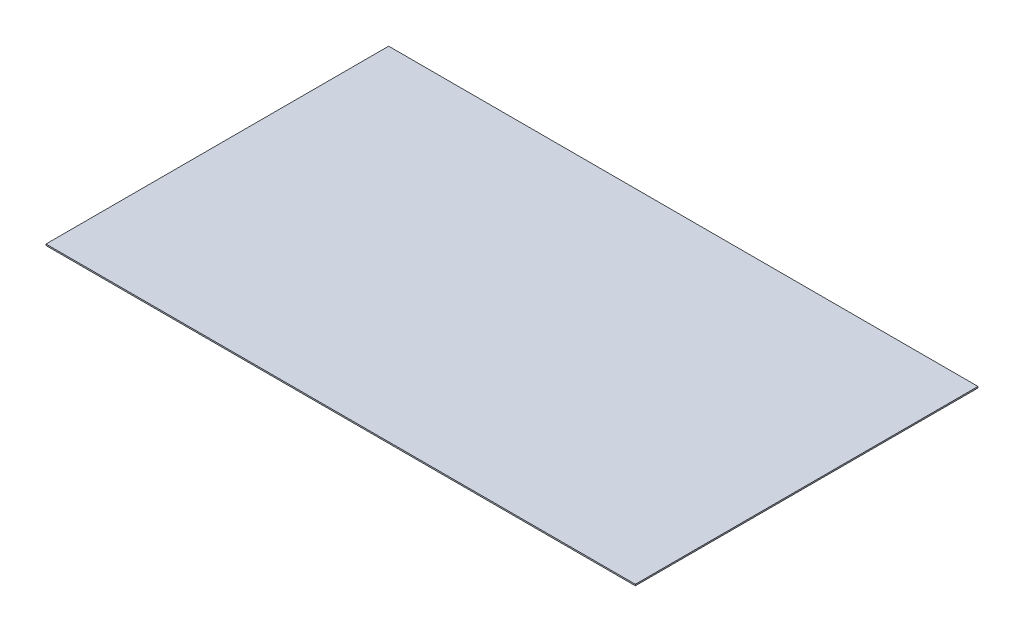
ISO-10303-21;
HEADER;
FILE_DESCRIPTION(('STEP AP214'),'2;1');
FILE_NAME('part.step','',(''),(''),'','','');
FILE_SCHEMA(('AUTOMOTIVE_DESIGN { 1 0 10303 214 1 1 1 1 }'));
ENDSEC;
DATA;
#1=APPLICATION_CONTEXT('core data for automotive mechanical design processes');
#2=APPLICATION_PROTOCOL_DEFINITION('international standard','automotive_design',2000,#1);
#3=PRODUCT_CONTEXT('',#1,'mechanical');
#4=PRODUCT('Part','Part','',(#3));
#5=PRODUCT_RELATED_PRODUCT_CATEGORY('part','',(#4));
#6=PRODUCT_DEFINITION_FORMATION('','',#4);
#7=PRODUCT_DEFINITION_CONTEXT('part definition',#1,'design');
#8=PRODUCT_DEFINITION('design','',#6,#7);
#9=PRODUCT_DEFINITION_SHAPE('','',#8);
#10=(LENGTH_UNIT() NAMED_UNIT(*) SI_UNIT(.MILLI.,.METRE.));
#11=(NAMED_UNIT(*) PLANE_ANGLE_UNIT() SI_UNIT($,.RADIAN.));
#12=(NAMED_UNIT(*) SI_UNIT($,.STERADIAN.) SOLID_ANGLE_UNIT());
#13=UNCERTAINTY_MEASURE_WITH_UNIT(LENGTH_MEASURE(1.E-05),#10,'distance_accuracy_value','');
#14=(GEOMETRIC_REPRESENTATION_CONTEXT(3) GLOBAL_UNCERTAINTY_ASSIGNED_CONTEXT((#13)) GLOBAL_UNIT_ASSIGNED_CONTEXT((#10,
#11,#12)) REPRESENTATION_CONTEXT('',''));
#15=CARTESIAN_POINT('',(0.,0.,0.));
#16=DIRECTION('',(0.,0.,1.));
#17=DIRECTION('',(1.,0.,0.));
#18=AXIS2_PLACEMENT_3D('',#15,#16,#17);
#19=CARTESIAN_POINT('',(0.,1.,0.));
#20=DIRECTION('',(1.,0.,0.));
#21=DIRECTION('',(0.,0.,-1.));
#22=AXIS2_PLACEMENT_3D('',#19,#20,#21);
#23=PLANE('',#22);
#24=DIRECTION('',(0.,0.,1.));
#25=VECTOR('',#24,1.);
#26=CARTESIAN_POINT('',(0.,0.,0.));
#27=LINE('',#26,#25);
#28=CARTESIAN_POINT('',(0.,0.,-250.));
#29=VERTEX_POINT('',#28);
#30=CARTESIAN_POINT('',(0.,0.,0.));
#31=VERTEX_POINT('',#30);
#32=EDGE_CURVE('E97',#29,#31,#27,.T.);
#33=ORIENTED_EDGE('',*,*,#32,.T.);
#34=DIRECTION('',(0.,-1.,0.));
#35=VECTOR('',#34,1.);
#36=CARTESIAN_POINT('',(0.,1.,0.));
#37=LINE('',#36,#35);
#38=CARTESIAN_POINT('',(0.,1.,0.));
#39=VERTEX_POINT('',#38);
#40=EDGE_CURVE('E11',#39,#31,#37,.T.);
#41=ORIENTED_EDGE('',*,*,#40,.F.);
#42=DIRECTION('',(0.,0.,1.));
#43=VECTOR('',#42,1.);
#44=CARTESIAN_POINT('',(0.,1.,0.));
#45=LINE('',#44,#43);
#46=CARTESIAN_POINT('',(0.,1.,-250.));
#47=VERTEX_POINT('',#46);
#48=EDGE_CURVE('E85',#47,#39,#45,.T.);
#49=ORIENTED_EDGE('',*,*,#48,.F.);
#50=DIRECTION('',(0.,-1.,0.));
#51=VECTOR('',#50,1.);
#52=CARTESIAN_POINT('',(0.,1.,-250.));
#53=LINE('',#52,#51);
#54=EDGE_CURVE('E93',#47,#29,#53,.T.);
#55=ORIENTED_EDGE('',*,*,#54,.T.);
#56=EDGE_LOOP('',(#33,#41,#49,#55));
#57=FACE_BOUND('',#56,.T.);
#58=ADVANCED_FACE('F34',(#57),#23,.F.);
#59=CARTESIAN_POINT('',(0.,1.,0.));
#60=DIRECTION('',(0.,0.,-1.));
#61=DIRECTION('',(-1.,0.,0.));
#62=AXIS2_PLACEMENT_3D('',#59,#60,#61);
#63=PLANE('',#62);
#64=DIRECTION('',(1.,0.,0.));
#65=VECTOR('',#64,1.);
#66=CARTESIAN_POINT('',(0.,0.,0.));
#67=LINE('',#66,#65);
#68=CARTESIAN_POINT('',(430.,0.,0.));
#69=VERTEX_POINT('',#68);
#70=EDGE_CURVE('E89',#31,#69,#67,.T.);
#71=ORIENTED_EDGE('',*,*,#70,.T.);
#72=DIRECTION('',(0.,-1.,0.));
#73=VECTOR('',#72,1.);
#74=CARTESIAN_POINT('',(430.,1.,0.));
#75=LINE('',#74,#73);
#76=CARTESIAN_POINT('',(430.,1.,0.));
#77=VERTEX_POINT('',#76);
#78=EDGE_CURVE('E42',#77,#69,#75,.T.);
#79=ORIENTED_EDGE('',*,*,#78,.F.);
#80=DIRECTION('',(1.,0.,0.));
#81=VECTOR('',#80,1.);
#82=CARTESIAN_POINT('',(0.,1.,0.));
#83=LINE('',#82,#81);
#84=EDGE_CURVE('E80',#39,#77,#83,.T.);
#85=ORIENTED_EDGE('',*,*,#84,.F.);
#86=ORIENTED_EDGE('',*,*,#40,.T.);
#87=EDGE_LOOP('',(#71,#79,#85,#86));
#88=FACE_BOUND('',#87,.T.);
#89=ADVANCED_FACE('F88',(#88),#63,.F.);
#90=CARTESIAN_POINT('',(430.,1.,0.));
#91=DIRECTION('',(-1.,0.,0.));
#92=DIRECTION('',(0.,0.,1.));
#93=AXIS2_PLACEMENT_3D('',#90,#91,#92);
#94=PLANE('',#93);
#95=DIRECTION('',(0.,0.,-1.));
#96=VECTOR('',#95,1.);
#97=CARTESIAN_POINT('',(430.,0.,0.));
#98=LINE('',#97,#96);
#99=CARTESIAN_POINT('',(430.,0.,-250.));
#100=VERTEX_POINT('',#99);
#101=EDGE_CURVE('E67',#69,#100,#98,.T.);
#102=ORIENTED_EDGE('',*,*,#101,.T.);
#103=DIRECTION('',(0.,-1.,0.));
#104=VECTOR('',#103,1.);
#105=CARTESIAN_POINT('',(430.,1.,-250.));
#106=LINE('',#105,#104);
#107=CARTESIAN_POINT('',(430.,1.,-250.));
#108=VERTEX_POINT('',#107);
#109=EDGE_CURVE('E90',#108,#100,#106,.T.);
#110=ORIENTED_EDGE('',*,*,#109,.F.);
#111=DIRECTION('',(0.,0.,-1.));
#112=VECTOR('',#111,1.);
#113=CARTESIAN_POINT('',(430.,1.,0.));
#114=LINE('',#113,#112);
#115=EDGE_CURVE('E83',#77,#108,#114,.T.);
#116=ORIENTED_EDGE('',*,*,#115,.F.);
#117=ORIENTED_EDGE('',*,*,#78,.T.);
#118=EDGE_LOOP('',(#102,#110,#116,#117));
#119=FACE_BOUND('',#118,.T.);
#120=ADVANCED_FACE('F91',(#119),#94,.F.);
#121=CARTESIAN_POINT('',(0.,1.,-250.));
#122=DIRECTION('',(0.,0.,1.));
#123=DIRECTION('',(1.,0.,0.));
#124=AXIS2_PLACEMENT_3D('',#121,#122,#123);
#125=PLANE('',#124);
#126=DIRECTION('',(-1.,0.,0.));
#127=VECTOR('',#126,1.);
#128=CARTESIAN_POINT('',(0.,0.,-250.));
#129=LINE('',#128,#127);
#130=EDGE_CURVE('E73',#100,#29,#129,.T.);
#131=ORIENTED_EDGE('',*,*,#130,.T.);
#132=ORIENTED_EDGE('',*,*,#54,.F.);
#133=DIRECTION('',(-1.,0.,0.));
#134=VECTOR('',#133,1.);
#135=CARTESIAN_POINT('',(0.,1.,-250.));
#136=LINE('',#135,#134);
#137=EDGE_CURVE('E50',#108,#47,#136,.T.);
#138=ORIENTED_EDGE('',*,*,#137,.F.);
#139=ORIENTED_EDGE('',*,*,#109,.T.);
#140=EDGE_LOOP('',(#131,#132,#138,#139));
#141=FACE_BOUND('',#140,.T.);
#142=ADVANCED_FACE('F104',(#141),#125,.F.);
#143=CARTESIAN_POINT('',(0.,1.,0.));
#144=DIRECTION('',(0.,-1.,0.));
#145=DIRECTION('',(0.,0.,-1.));
#146=AXIS2_PLACEMENT_3D('',#143,#144,#145);
#147=PLANE('',#146);
#148=ORIENTED_EDGE('',*,*,#48,.T.);
#149=ORIENTED_EDGE('',*,*,#84,.T.);
#150=ORIENTED_EDGE('',*,*,#115,.T.);
#151=ORIENTED_EDGE('',*,*,#137,.T.);
#152=EDGE_LOOP('',(#148,#149,#150,#151));
#153=FACE_BOUND('',#152,.T.);
#154=ADVANCED_FACE('F81',(#153),#147,.F.);
#155=CARTESIAN_POINT('',(0.,0.,0.));
#156=DIRECTION('',(0.,-1.,0.));
#157=DIRECTION('',(0.,0.,-1.));
#158=AXIS2_PLACEMENT_3D('',#155,#156,#157);
#159=PLANE('',#158);
#160=ORIENTED_EDGE('',*,*,#32,.F.);
#161=ORIENTED_EDGE('',*,*,#130,.F.);
#162=ORIENTED_EDGE('',*,*,#101,.F.);
#163=ORIENTED_EDGE('',*,*,#70,.F.);
#164=EDGE_LOOP('',(#160,#161,#162,#163));
#165=FACE_BOUND('',#164,.T.);
#166=ADVANCED_FACE('F107',(#165),#159,.T.);
#167=CLOSED_SHELL('',(#58,#89,#120,#142,#154,#166));
#168=MANIFOLD_SOLID_BREP('B2',#167);
#169=ADVANCED_BREP_SHAPE_REPRESENTATION('',(#18,#168),#14);
#170=SHAPE_DEFINITION_REPRESENTATION(#9,#169);
ENDSEC;
END-ISO-10303-21;
